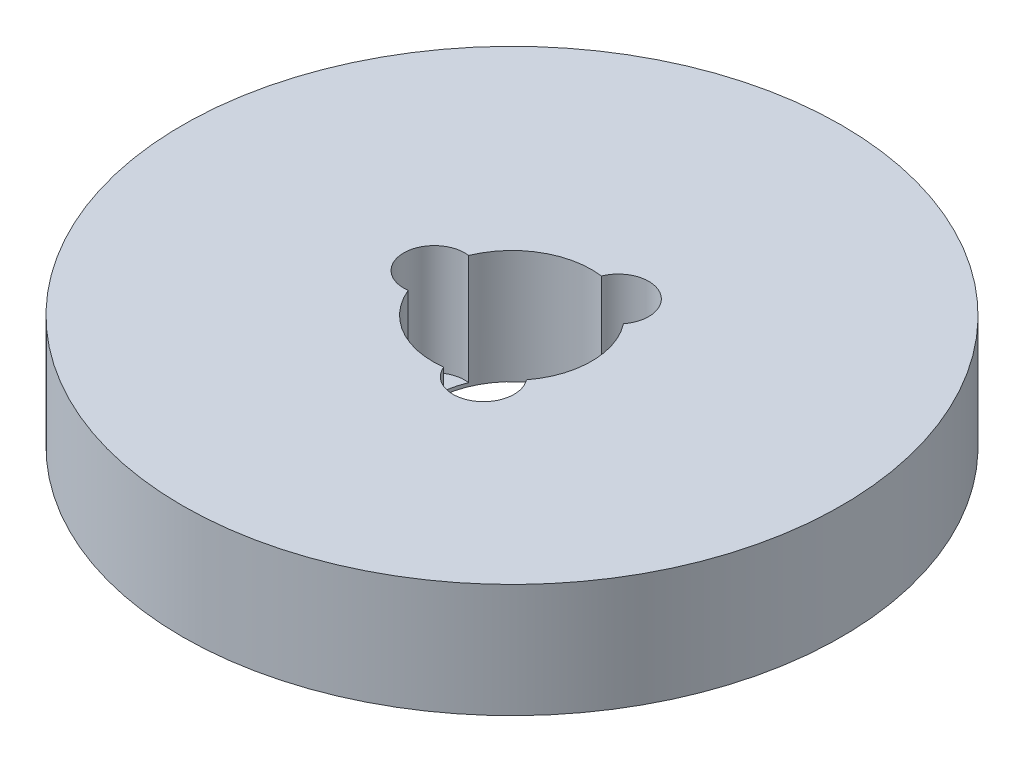
ISO-10303-21;
HEADER;
FILE_DESCRIPTION(('STEP AP214'),'2;1');
FILE_NAME('part.step','',(''),(''),'','','');
FILE_SCHEMA(('AUTOMOTIVE_DESIGN { 1 0 10303 214 1 1 1 1 }'));
ENDSEC;
DATA;
#1=APPLICATION_CONTEXT('core data for automotive mechanical design processes');
#2=APPLICATION_PROTOCOL_DEFINITION('international standard','automotive_design',2000,#1);
#3=PRODUCT_CONTEXT('',#1,'mechanical');
#4=PRODUCT('Part','Part','',(#3));
#5=PRODUCT_RELATED_PRODUCT_CATEGORY('part','',(#4));
#6=PRODUCT_DEFINITION_FORMATION('','',#4);
#7=PRODUCT_DEFINITION_CONTEXT('part definition',#1,'design');
#8=PRODUCT_DEFINITION('design','',#6,#7);
#9=PRODUCT_DEFINITION_SHAPE('','',#8);
#10=(LENGTH_UNIT() NAMED_UNIT(*) SI_UNIT(.MILLI.,.METRE.));
#11=(NAMED_UNIT(*) PLANE_ANGLE_UNIT() SI_UNIT($,.RADIAN.));
#12=(NAMED_UNIT(*) SI_UNIT($,.STERADIAN.) SOLID_ANGLE_UNIT());
#13=UNCERTAINTY_MEASURE_WITH_UNIT(LENGTH_MEASURE(1.E-05),#10,'distance_accuracy_value','');
#14=(GEOMETRIC_REPRESENTATION_CONTEXT(3) GLOBAL_UNCERTAINTY_ASSIGNED_CONTEXT((#13)) GLOBAL_UNIT_ASSIGNED_CONTEXT((#10,
#11,#12)) REPRESENTATION_CONTEXT('',''));
#15=CARTESIAN_POINT('',(0.,0.,0.));
#16=DIRECTION('',(0.,0.,1.));
#17=DIRECTION('',(1.,0.,0.));
#18=AXIS2_PLACEMENT_3D('',#15,#16,#17);
#19=CARTESIAN_POINT('',(0.,25.,0.));
#20=DIRECTION('',(0.,-1.,0.));
#21=DIRECTION('',(0.,0.,-1.));
#22=AXIS2_PLACEMENT_3D('',#19,#20,#21);
#23=CYLINDRICAL_SURFACE('',#22,72.5);
#24=CARTESIAN_POINT('',(0.,25.,0.));
#25=DIRECTION('',(0.,1.,0.));
#26=DIRECTION('',(0.,0.,1.));
#27=AXIS2_PLACEMENT_3D('',#24,#25,#26);
#28=CIRCLE('',#27,72.5);
#29=CARTESIAN_POINT('',(0.,25.,72.5));
#30=VERTEX_POINT('',#29);
#31=EDGE_CURVE('E126',#30,#30,#28,.T.);
#32=ORIENTED_EDGE('',*,*,#31,.F.);
#33=EDGE_LOOP('',(#32));
#34=FACE_BOUND('',#33,.T.);
#35=CARTESIAN_POINT('',(0.,0.,0.));
#36=DIRECTION('',(0.,1.,0.));
#37=DIRECTION('',(0.,0.,1.));
#38=AXIS2_PLACEMENT_3D('',#35,#36,#37);
#39=CIRCLE('',#38,72.5);
#40=CARTESIAN_POINT('',(0.,0.,72.5));
#41=VERTEX_POINT('',#40);
#42=EDGE_CURVE('E124',#41,#41,#39,.T.);
#43=ORIENTED_EDGE('',*,*,#42,.T.);
#44=EDGE_LOOP('',(#43));
#45=FACE_BOUND('',#44,.T.);
#46=ADVANCED_FACE('F39',(#34,#45),#23,.T.);
#47=CARTESIAN_POINT('',(0.,25.,0.));
#48=DIRECTION('',(0.,1.,0.));
#49=DIRECTION('',(0.,0.,1.));
#50=AXIS2_PLACEMENT_3D('',#47,#48,#49);
#51=PLANE('',#50);
#52=CARTESIAN_POINT('',(8.55231111828378,25.,14.8130373790035));
#53=DIRECTION('',(0.,1.,0.));
#54=DIRECTION('',(0.866025403784436,0.,-0.500000000000004));
#55=AXIS2_PLACEMENT_3D('',#52,#53,#54);
#56=CIRCLE('',#55,6.72175530353635);
#57=CARTESIAN_POINT('',(2.32557606108409,25.,17.3447887269956));
#58=VERTEX_POINT('',#57);
#59=CARTESIAN_POINT('',(13.8582396303102,25.,10.6864023108294));
#60=VERTEX_POINT('',#59);
#61=EDGE_CURVE('E147',#58,#60,#56,.T.);
#62=ORIENTED_EDGE('',*,*,#61,.F.);
#63=CARTESIAN_POINT('',(0.,25.,0.));
#64=DIRECTION('',(0.,1.,0.));
#65=DIRECTION('',(0.,0.,1.));
#66=AXIS2_PLACEMENT_3D('',#63,#64,#65);
#67=CIRCLE('',#66,17.5);
#68=CARTESIAN_POINT('',(-16.1838156913941,25.,6.65838641616609));
#69=VERTEX_POINT('',#68);
#70=EDGE_CURVE('E118',#69,#58,#67,.T.);
#71=ORIENTED_EDGE('',*,*,#70,.F.);
#72=CARTESIAN_POINT('',(-17.1046222365674,25.,0.));
#73=DIRECTION('',(0.,1.,0.));
#74=DIRECTION('',(0.,0.,1.));
#75=AXIS2_PLACEMENT_3D('',#72,#73,#74);
#76=CIRCLE('',#75,6.72175530353635);
#77=CARTESIAN_POINT('',(-16.1838156913941,25.,-6.65838641616609));
#78=VERTEX_POINT('',#77);
#79=EDGE_CURVE('E113',#78,#69,#76,.T.);
#80=ORIENTED_EDGE('',*,*,#79,.F.);
#81=CARTESIAN_POINT('',(2.32557606108385,25.,-17.3447887269956));
#82=VERTEX_POINT('',#81);
#83=EDGE_CURVE('E106',#82,#78,#67,.T.);
#84=ORIENTED_EDGE('',*,*,#83,.F.);
#85=CARTESIAN_POINT('',(8.55231111828357,25.,-14.8130373790037));
#86=DIRECTION('',(0.,1.,0.));
#87=DIRECTION('',(-0.866025403784443,0.,-0.499999999999992));
#88=AXIS2_PLACEMENT_3D('',#85,#86,#87);
#89=CIRCLE('',#88,6.72175530353635);
#90=CARTESIAN_POINT('',(13.85823963031,25.,-10.6864023108296));
#91=VERTEX_POINT('',#90);
#92=EDGE_CURVE('E90',#91,#82,#89,.T.);
#93=ORIENTED_EDGE('',*,*,#92,.F.);
#94=EDGE_CURVE('E116',#60,#91,#67,.T.);
#95=ORIENTED_EDGE('',*,*,#94,.F.);
#96=EDGE_LOOP('',(#62,#71,#80,#84,#93,#95));
#97=FACE_BOUND('',#96,.T.);
#98=ORIENTED_EDGE('',*,*,#31,.T.);
#99=EDGE_LOOP('',(#98));
#100=FACE_BOUND('',#99,.T.);
#101=ADVANCED_FACE('F115',(#97,#100),#51,.T.);
#102=CARTESIAN_POINT('',(0.,0.,0.));
#103=DIRECTION('',(0.,1.,0.));
#104=DIRECTION('',(0.,0.,1.));
#105=AXIS2_PLACEMENT_3D('',#102,#103,#104);
#106=PLANE('',#105);
#107=CARTESIAN_POINT('',(0.,0.,0.));
#108=DIRECTION('',(0.,1.,0.));
#109=DIRECTION('',(0.,0.,1.));
#110=AXIS2_PLACEMENT_3D('',#107,#108,#109);
#111=CIRCLE('',#110,17.5);
#112=CARTESIAN_POINT('',(0.,0.,17.5));
#113=VERTEX_POINT('',#112);
#114=EDGE_CURVE('E120',#113,#113,#111,.T.);
#115=ORIENTED_EDGE('',*,*,#114,.T.);
#116=EDGE_LOOP('',(#115));
#117=FACE_BOUND('',#116,.T.);
#118=ORIENTED_EDGE('',*,*,#42,.F.);
#119=EDGE_LOOP('',(#118));
#120=FACE_BOUND('',#119,.T.);
#121=ADVANCED_FACE('F164',(#117,#120),#106,.F.);
#122=CARTESIAN_POINT('',(0.,25.,0.));
#123=DIRECTION('',(0.,-1.,0.));
#124=DIRECTION('',(0.,0.,-1.));
#125=AXIS2_PLACEMENT_3D('',#122,#123,#124);
#126=CYLINDRICAL_SURFACE('',#125,17.5);
#127=DIRECTION('',(0.,1.,0.));
#128=VECTOR('',#127,1.);
#129=CARTESIAN_POINT('',(2.3255760610841,12.8826878494579,17.3447887269956));
#130=LINE('',#129,#128);
#131=CARTESIAN_POINT('',(2.32557606108409,0.765375698915712,17.3447887269956));
#132=VERTEX_POINT('',#131);
#133=EDGE_CURVE('E11',#132,#58,#130,.T.);
#134=ORIENTED_EDGE('',*,*,#133,.F.);
#135=CARTESIAN_POINT('',(0.,0.765375698915712,0.));
#136=DIRECTION('',(0.,1.,0.));
#137=DIRECTION('',(0.,0.,1.));
#138=AXIS2_PLACEMENT_3D('',#135,#136,#137);
#139=CIRCLE('',#138,17.5);
#140=CARTESIAN_POINT('',(13.8582396303102,0.765375698915712,10.6864023108294));
#141=VERTEX_POINT('',#140);
#142=EDGE_CURVE('E144',#132,#141,#139,.T.);
#143=ORIENTED_EDGE('',*,*,#142,.T.);
#144=DIRECTION('',(0.,1.,0.));
#145=VECTOR('',#144,1.);
#146=CARTESIAN_POINT('',(13.8582396303102,12.8826878494579,10.6864023108294));
#147=LINE('',#146,#145);
#148=EDGE_CURVE('E46',#60,#141,#147,.F.);
#149=ORIENTED_EDGE('',*,*,#148,.F.);
#150=ORIENTED_EDGE('',*,*,#94,.T.);
#151=DIRECTION('',(0.,1.,0.));
#152=VECTOR('',#151,1.);
#153=CARTESIAN_POINT('',(13.85823963031,12.8826878494579,-10.6864023108296));
#154=LINE('',#153,#152);
#155=CARTESIAN_POINT('',(13.85823963031,0.765375698915712,-10.6864023108296));
#156=VERTEX_POINT('',#155);
#157=EDGE_CURVE('E92',#156,#91,#154,.T.);
#158=ORIENTED_EDGE('',*,*,#157,.F.);
#159=CARTESIAN_POINT('',(0.,0.765375698915712,0.));
#160=DIRECTION('',(0.,1.,0.));
#161=DIRECTION('',(0.,0.,1.));
#162=AXIS2_PLACEMENT_3D('',#159,#160,#161);
#163=CIRCLE('',#162,17.5);
#164=CARTESIAN_POINT('',(2.32557606108385,0.765375698915712,-17.3447887269956));
#165=VERTEX_POINT('',#164);
#166=EDGE_CURVE('E107',#156,#165,#163,.T.);
#167=ORIENTED_EDGE('',*,*,#166,.T.);
#168=DIRECTION('',(0.,1.,0.));
#169=VECTOR('',#168,1.);
#170=CARTESIAN_POINT('',(2.32557606108385,12.8826878494579,-17.3447887269956));
#171=LINE('',#170,#169);
#172=EDGE_CURVE('E95',#82,#165,#171,.F.);
#173=ORIENTED_EDGE('',*,*,#172,.F.);
#174=ORIENTED_EDGE('',*,*,#83,.T.);
#175=DIRECTION('',(0.,1.,0.));
#176=VECTOR('',#175,1.);
#177=CARTESIAN_POINT('',(-16.1838156913941,12.8826878494579,-6.65838641616609));
#178=LINE('',#177,#176);
#179=CARTESIAN_POINT('',(-16.1838156913941,0.765375698915712,-6.65838641616609));
#180=VERTEX_POINT('',#179);
#181=EDGE_CURVE('E143',#180,#78,#178,.T.);
#182=ORIENTED_EDGE('',*,*,#181,.F.);
#183=CARTESIAN_POINT('',(0.,0.765375698915712,0.));
#184=DIRECTION('',(0.,1.,0.));
#185=DIRECTION('',(0.,0.,1.));
#186=AXIS2_PLACEMENT_3D('',#183,#184,#185);
#187=CIRCLE('',#186,17.5);
#188=CARTESIAN_POINT('',(-16.1838156913941,0.765375698915712,6.65838641616609));
#189=VERTEX_POINT('',#188);
#190=EDGE_CURVE('E132',#180,#189,#187,.T.);
#191=ORIENTED_EDGE('',*,*,#190,.T.);
#192=DIRECTION('',(0.,1.,0.));
#193=VECTOR('',#192,1.);
#194=CARTESIAN_POINT('',(-16.1838156913941,12.8826878494579,6.65838641616609));
#195=LINE('',#194,#193);
#196=EDGE_CURVE('E137',#69,#189,#195,.F.);
#197=ORIENTED_EDGE('',*,*,#196,.F.);
#198=ORIENTED_EDGE('',*,*,#70,.T.);
#199=EDGE_LOOP('',(#134,#143,#149,#150,#158,#167,#173,#174,#182,#191,#197,#198));
#200=FACE_BOUND('',#199,.T.);
#201=ORIENTED_EDGE('',*,*,#114,.F.);
#202=EDGE_LOOP('',(#201));
#203=FACE_BOUND('',#202,.T.);
#204=ADVANCED_FACE('F103',(#200,#203),#126,.F.);
#205=CARTESIAN_POINT('',(-17.1046222365674,0.765375698915712,0.));
#206=DIRECTION('',(0.,1.,0.));
#207=DIRECTION('',(0.,0.,1.));
#208=AXIS2_PLACEMENT_3D('',#205,#206,#207);
#209=CYLINDRICAL_SURFACE('',#208,6.72175530353635);
#210=ORIENTED_EDGE('',*,*,#181,.T.);
#211=ORIENTED_EDGE('',*,*,#79,.T.);
#212=ORIENTED_EDGE('',*,*,#196,.T.);
#213=CARTESIAN_POINT('',(-17.1046222365674,0.765375698915712,0.));
#214=DIRECTION('',(0.,1.,0.));
#215=DIRECTION('',(0.,0.,1.));
#216=AXIS2_PLACEMENT_3D('',#213,#214,#215);
#217=CIRCLE('',#216,6.72175530353635);
#218=EDGE_CURVE('E121',#180,#189,#217,.T.);
#219=ORIENTED_EDGE('',*,*,#218,.F.);
#220=EDGE_LOOP('',(#210,#211,#212,#219));
#221=FACE_BOUND('',#220,.T.);
#222=ADVANCED_FACE('F174',(#221),#209,.F.);
#223=CARTESIAN_POINT('',(-17.1046222365674,0.765375698915712,0.));
#224=DIRECTION('',(0.,1.,0.));
#225=DIRECTION('',(0.,0.,1.));
#226=AXIS2_PLACEMENT_3D('',#223,#224,#225);
#227=PLANE('',#226);
#228=ORIENTED_EDGE('',*,*,#218,.T.);
#229=ORIENTED_EDGE('',*,*,#190,.F.);
#230=EDGE_LOOP('',(#228,#229));
#231=FACE_BOUND('',#230,.T.);
#232=ADVANCED_FACE('F177',(#231),#227,.T.);
#233=CARTESIAN_POINT('',(8.55231111828357,0.765375698915712,-14.8130373790037));
#234=DIRECTION('',(0.,1.,0.));
#235=DIRECTION('',(0.,0.,1.));
#236=AXIS2_PLACEMENT_3D('',#233,#234,#235);
#237=CYLINDRICAL_SURFACE('',#236,6.72175530353635);
#238=ORIENTED_EDGE('',*,*,#157,.T.);
#239=ORIENTED_EDGE('',*,*,#92,.T.);
#240=ORIENTED_EDGE('',*,*,#172,.T.);
#241=CARTESIAN_POINT('',(8.55231111828357,0.765375698915712,-14.8130373790037));
#242=DIRECTION('',(0.,1.,0.));
#243=DIRECTION('',(-0.866025403784443,0.,-0.499999999999992));
#244=AXIS2_PLACEMENT_3D('',#241,#242,#243);
#245=CIRCLE('',#244,6.72175530353635);
#246=EDGE_CURVE('E56',#156,#165,#245,.T.);
#247=ORIENTED_EDGE('',*,*,#246,.F.);
#248=EDGE_LOOP('',(#238,#239,#240,#247));
#249=FACE_BOUND('',#248,.T.);
#250=ADVANCED_FACE('F93',(#249),#237,.F.);
#251=CARTESIAN_POINT('',(8.55231111828357,0.765375698915712,-14.8130373790037));
#252=DIRECTION('',(0.,1.,0.));
#253=DIRECTION('',(-0.866025403784443,0.,-0.499999999999992));
#254=AXIS2_PLACEMENT_3D('',#251,#252,#253);
#255=PLANE('',#254);
#256=ORIENTED_EDGE('',*,*,#246,.T.);
#257=ORIENTED_EDGE('',*,*,#166,.F.);
#258=EDGE_LOOP('',(#256,#257));
#259=FACE_BOUND('',#258,.T.);
#260=ADVANCED_FACE('F160',(#259),#255,.T.);
#261=CARTESIAN_POINT('',(8.55231111828378,0.765375698915712,14.8130373790035));
#262=DIRECTION('',(0.,1.,0.));
#263=DIRECTION('',(0.,0.,1.));
#264=AXIS2_PLACEMENT_3D('',#261,#262,#263);
#265=CYLINDRICAL_SURFACE('',#264,6.72175530353635);
#266=ORIENTED_EDGE('',*,*,#133,.T.);
#267=ORIENTED_EDGE('',*,*,#61,.T.);
#268=ORIENTED_EDGE('',*,*,#148,.T.);
#269=CARTESIAN_POINT('',(8.55231111828378,0.765375698915712,14.8130373790035));
#270=DIRECTION('',(0.,1.,0.));
#271=DIRECTION('',(0.866025403784436,0.,-0.500000000000004));
#272=AXIS2_PLACEMENT_3D('',#269,#270,#271);
#273=CIRCLE('',#272,6.72175530353635);
#274=EDGE_CURVE('E55',#132,#141,#273,.T.);
#275=ORIENTED_EDGE('',*,*,#274,.F.);
#276=EDGE_LOOP('',(#266,#267,#268,#275));
#277=FACE_BOUND('',#276,.T.);
#278=ADVANCED_FACE('F149',(#277),#265,.F.);
#279=CARTESIAN_POINT('',(8.55231111828378,0.765375698915712,14.8130373790035));
#280=DIRECTION('',(0.,1.,0.));
#281=DIRECTION('',(0.866025403784436,0.,-0.500000000000004));
#282=AXIS2_PLACEMENT_3D('',#279,#280,#281);
#283=PLANE('',#282);
#284=ORIENTED_EDGE('',*,*,#274,.T.);
#285=ORIENTED_EDGE('',*,*,#142,.F.);
#286=EDGE_LOOP('',(#284,#285));
#287=FACE_BOUND('',#286,.T.);
#288=ADVANCED_FACE('F151',(#287),#283,.T.);
#289=CLOSED_SHELL('',(#46,#101,#121,#204,#222,#232,#250,#260,#278,#288));
#290=MANIFOLD_SOLID_BREP('B2',#289);
#291=ADVANCED_BREP_SHAPE_REPRESENTATION('',(#18,#290),#14);
#292=SHAPE_DEFINITION_REPRESENTATION(#9,#291);
ENDSEC;
END-ISO-10303-21;
